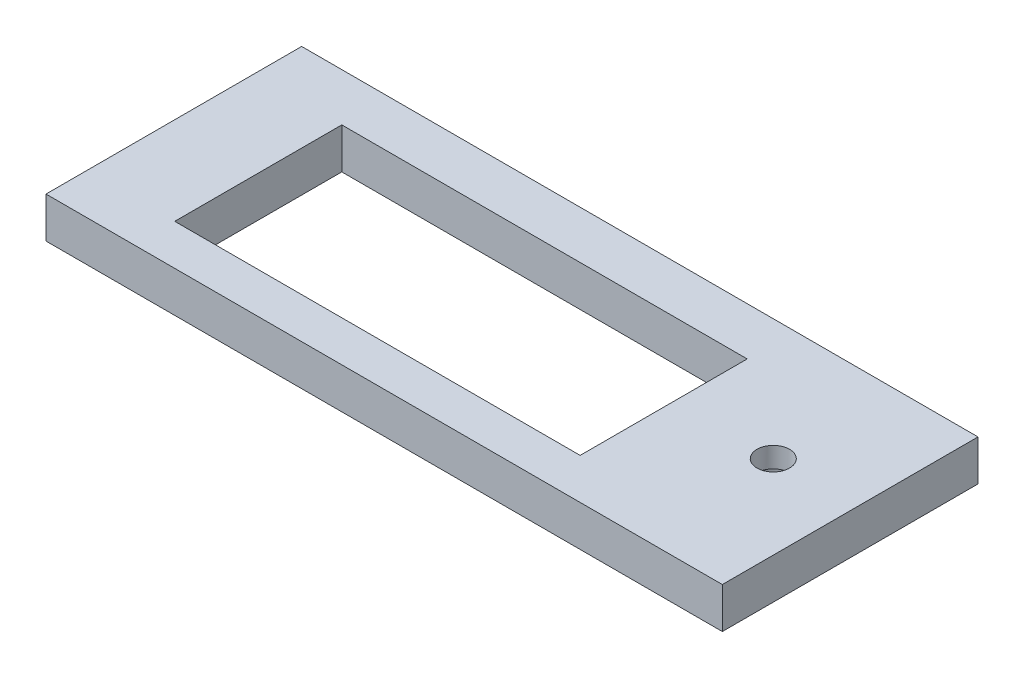
ISO-10303-21;
HEADER;
FILE_DESCRIPTION(('STEP AP214'),'2;1');
FILE_NAME('part.step','',(''),(''),'','','');
FILE_SCHEMA(('AUTOMOTIVE_DESIGN { 1 0 10303 214 1 1 1 1 }'));
ENDSEC;
DATA;
#1=APPLICATION_CONTEXT('core data for automotive mechanical design processes');
#2=APPLICATION_PROTOCOL_DEFINITION('international standard','automotive_design',2000,#1);
#3=PRODUCT_CONTEXT('',#1,'mechanical');
#4=PRODUCT('Part','Part','',(#3));
#5=PRODUCT_RELATED_PRODUCT_CATEGORY('part','',(#4));
#6=PRODUCT_DEFINITION_FORMATION('','',#4);
#7=PRODUCT_DEFINITION_CONTEXT('part definition',#1,'design');
#8=PRODUCT_DEFINITION('design','',#6,#7);
#9=PRODUCT_DEFINITION_SHAPE('','',#8);
#10=(LENGTH_UNIT() NAMED_UNIT(*) SI_UNIT(.MILLI.,.METRE.));
#11=(NAMED_UNIT(*) PLANE_ANGLE_UNIT() SI_UNIT($,.RADIAN.));
#12=(NAMED_UNIT(*) SI_UNIT($,.STERADIAN.) SOLID_ANGLE_UNIT());
#13=UNCERTAINTY_MEASURE_WITH_UNIT(LENGTH_MEASURE(1.E-05),#10,'distance_accuracy_value','');
#14=(GEOMETRIC_REPRESENTATION_CONTEXT(3) GLOBAL_UNCERTAINTY_ASSIGNED_CONTEXT((#13)) GLOBAL_UNIT_ASSIGNED_CONTEXT((#10,
#11,#12)) REPRESENTATION_CONTEXT('',''));
#15=CARTESIAN_POINT('',(0.,0.,0.));
#16=DIRECTION('',(0.,0.,1.));
#17=DIRECTION('',(1.,0.,0.));
#18=AXIS2_PLACEMENT_3D('',#15,#16,#17);
#19=CARTESIAN_POINT('',(62.5,0.,-1.62500000000001));
#20=DIRECTION('',(0.,1.,0.));
#21=DIRECTION('',(0.,0.,1.));
#22=AXIS2_PLACEMENT_3D('',#19,#20,#21);
#23=CYLINDRICAL_SURFACE('',#22,4.00000000000001);
#24=CARTESIAN_POINT('',(62.5,10.,-1.62500000000001));
#25=DIRECTION('',(0.,1.,0.));
#26=DIRECTION('',(0.,0.,1.));
#27=AXIS2_PLACEMENT_3D('',#24,#25,#26);
#28=CIRCLE('',#27,4.00000000000001);
#29=CARTESIAN_POINT('',(62.5,10.,2.375));
#30=VERTEX_POINT('',#29);
#31=EDGE_CURVE('E187',#30,#30,#28,.T.);
#32=ORIENTED_EDGE('',*,*,#31,.T.);
#33=EDGE_LOOP('',(#32));
#34=FACE_BOUND('',#33,.T.);
#35=CARTESIAN_POINT('',(62.5,5.,-1.62500000000001));
#36=DIRECTION('',(0.,-1.,0.));
#37=DIRECTION('',(0.,0.,-1.));
#38=AXIS2_PLACEMENT_3D('',#35,#36,#37);
#39=CIRCLE('',#38,4.00000000000001);
#40=CARTESIAN_POINT('',(62.5,5.,-5.62500000000001));
#41=VERTEX_POINT('',#40);
#42=EDGE_CURVE('E40',#41,#41,#39,.F.);
#43=ORIENTED_EDGE('',*,*,#42,.F.);
#44=EDGE_LOOP('',(#43));
#45=FACE_BOUND('',#44,.T.);
#46=ADVANCED_FACE('F36',(#34,#45),#23,.F.);
#47=CARTESIAN_POINT('',(-75.,10.,-31.375));
#48=DIRECTION('',(0.,0.,1.));
#49=DIRECTION('',(1.,0.,0.));
#50=AXIS2_PLACEMENT_3D('',#47,#48,#49);
#51=PLANE('',#50);
#52=DIRECTION('',(-1.,0.,0.));
#53=VECTOR('',#52,1.);
#54=CARTESIAN_POINT('',(-75.,0.,-31.375));
#55=LINE('',#54,#53);
#56=CARTESIAN_POINT('',(83.,0.,-31.375));
#57=VERTEX_POINT('',#56);
#58=CARTESIAN_POINT('',(-83.,0.,-31.375));
#59=VERTEX_POINT('',#58);
#60=EDGE_CURVE('E247',#57,#59,#55,.T.);
#61=ORIENTED_EDGE('',*,*,#60,.T.);
#62=DIRECTION('',(0.,1.,0.));
#63=VECTOR('',#62,1.);
#64=CARTESIAN_POINT('',(-83.,0.,-31.375));
#65=LINE('',#64,#63);
#66=CARTESIAN_POINT('',(-83.,10.,-31.375));
#67=VERTEX_POINT('',#66);
#68=EDGE_CURVE('E169',#59,#67,#65,.T.);
#69=ORIENTED_EDGE('',*,*,#68,.T.);
#70=DIRECTION('',(-1.,0.,0.));
#71=VECTOR('',#70,1.);
#72=CARTESIAN_POINT('',(-75.,10.,-31.375));
#73=LINE('',#72,#71);
#74=CARTESIAN_POINT('',(83.,10.,-31.375));
#75=VERTEX_POINT('',#74);
#76=EDGE_CURVE('E45',#75,#67,#73,.T.);
#77=ORIENTED_EDGE('',*,*,#76,.F.);
#78=DIRECTION('',(0.,1.,0.));
#79=VECTOR('',#78,1.);
#80=CARTESIAN_POINT('',(83.,0.,-31.375));
#81=LINE('',#80,#79);
#82=EDGE_CURVE('E160',#57,#75,#81,.T.);
#83=ORIENTED_EDGE('',*,*,#82,.F.);
#84=EDGE_LOOP('',(#61,#69,#77,#83));
#85=FACE_BOUND('',#84,.T.);
#86=ADVANCED_FACE('F38',(#85),#51,.F.);
#87=CARTESIAN_POINT('',(-75.,10.,31.375));
#88=DIRECTION('',(0.,0.,-1.));
#89=DIRECTION('',(-1.,0.,0.));
#90=AXIS2_PLACEMENT_3D('',#87,#88,#89);
#91=PLANE('',#90);
#92=DIRECTION('',(1.,0.,0.));
#93=VECTOR('',#92,1.);
#94=CARTESIAN_POINT('',(-75.,0.,31.375));
#95=LINE('',#94,#93);
#96=CARTESIAN_POINT('',(-83.,0.,31.375));
#97=VERTEX_POINT('',#96);
#98=CARTESIAN_POINT('',(83.,0.,31.375));
#99=VERTEX_POINT('',#98);
#100=EDGE_CURVE('E253',#97,#99,#95,.T.);
#101=ORIENTED_EDGE('',*,*,#100,.T.);
#102=DIRECTION('',(0.,1.,0.));
#103=VECTOR('',#102,1.);
#104=CARTESIAN_POINT('',(83.,0.,31.375));
#105=LINE('',#104,#103);
#106=CARTESIAN_POINT('',(83.,10.,31.375));
#107=VERTEX_POINT('',#106);
#108=EDGE_CURVE('E156',#99,#107,#105,.T.);
#109=ORIENTED_EDGE('',*,*,#108,.T.);
#110=DIRECTION('',(1.,0.,0.));
#111=VECTOR('',#110,1.);
#112=CARTESIAN_POINT('',(-75.,10.,31.375));
#113=LINE('',#112,#111);
#114=CARTESIAN_POINT('',(-83.,10.,31.375));
#115=VERTEX_POINT('',#114);
#116=EDGE_CURVE('E11',#115,#107,#113,.T.);
#117=ORIENTED_EDGE('',*,*,#116,.F.);
#118=DIRECTION('',(0.,1.,0.));
#119=VECTOR('',#118,1.);
#120=CARTESIAN_POINT('',(-83.,0.,31.375));
#121=LINE('',#120,#119);
#122=EDGE_CURVE('E172',#97,#115,#121,.T.);
#123=ORIENTED_EDGE('',*,*,#122,.F.);
#124=EDGE_LOOP('',(#101,#109,#117,#123));
#125=FACE_BOUND('',#124,.T.);
#126=ADVANCED_FACE('F288',(#125),#91,.F.);
#127=CARTESIAN_POINT('',(0.,10.,0.));
#128=DIRECTION('',(0.,-1.,0.));
#129=DIRECTION('',(0.,0.,-1.));
#130=AXIS2_PLACEMENT_3D('',#127,#128,#129);
#131=PLANE('',#130);
#132=ORIENTED_EDGE('',*,*,#31,.F.);
#133=EDGE_LOOP('',(#132));
#134=FACE_BOUND('',#133,.T.);
#135=DIRECTION('',(-1.,0.,0.));
#136=VECTOR('',#135,1.);
#137=CARTESIAN_POINT('',(-61.4,10.,-19.625));
#138=LINE('',#137,#136);
#139=CARTESIAN_POINT('',(38.1,10.,-19.625));
#140=VERTEX_POINT('',#139);
#141=CARTESIAN_POINT('',(-61.4,10.,-19.625));
#142=VERTEX_POINT('',#141);
#143=EDGE_CURVE('E237',#140,#142,#138,.T.);
#144=ORIENTED_EDGE('',*,*,#143,.F.);
#145=DIRECTION('',(0.,0.,-1.));
#146=VECTOR('',#145,1.);
#147=CARTESIAN_POINT('',(38.1,10.,21.375));
#148=LINE('',#147,#146);
#149=CARTESIAN_POINT('',(38.1,10.,21.375));
#150=VERTEX_POINT('',#149);
#151=EDGE_CURVE('E61',#150,#140,#148,.T.);
#152=ORIENTED_EDGE('',*,*,#151,.F.);
#153=DIRECTION('',(1.,0.,0.));
#154=VECTOR('',#153,1.);
#155=CARTESIAN_POINT('',(-61.4,10.,21.375));
#156=LINE('',#155,#154);
#157=CARTESIAN_POINT('',(-61.4,10.,21.375));
#158=VERTEX_POINT('',#157);
#159=EDGE_CURVE('E226',#158,#150,#156,.T.);
#160=ORIENTED_EDGE('',*,*,#159,.F.);
#161=DIRECTION('',(0.,0.,1.));
#162=VECTOR('',#161,1.);
#163=CARTESIAN_POINT('',(-61.4,10.,21.375));
#164=LINE('',#163,#162);
#165=EDGE_CURVE('E240',#142,#158,#164,.T.);
#166=ORIENTED_EDGE('',*,*,#165,.F.);
#167=EDGE_LOOP('',(#144,#152,#160,#166));
#168=FACE_BOUND('',#167,.T.);
#169=ORIENTED_EDGE('',*,*,#116,.T.);
#170=DIRECTION('',(0.,0.,-1.));
#171=VECTOR('',#170,1.);
#172=CARTESIAN_POINT('',(83.,10.,-31.375));
#173=LINE('',#172,#171);
#174=EDGE_CURVE('E157',#107,#75,#173,.T.);
#175=ORIENTED_EDGE('',*,*,#174,.T.);
#176=ORIENTED_EDGE('',*,*,#76,.T.);
#177=DIRECTION('',(0.,0.,1.));
#178=VECTOR('',#177,1.);
#179=CARTESIAN_POINT('',(-83.,10.,-31.375));
#180=LINE('',#179,#178);
#181=EDGE_CURVE('E163',#67,#115,#180,.T.);
#182=ORIENTED_EDGE('',*,*,#181,.T.);
#183=EDGE_LOOP('',(#169,#175,#176,#182));
#184=FACE_BOUND('',#183,.T.);
#185=ADVANCED_FACE('F266',(#134,#168,#184),#131,.F.);
#186=CARTESIAN_POINT('',(0.,0.,0.));
#187=DIRECTION('',(0.,-1.,0.));
#188=DIRECTION('',(0.,0.,-1.));
#189=AXIS2_PLACEMENT_3D('',#186,#187,#188);
#190=PLANE('',#189);
#191=CARTESIAN_POINT('',(62.5,0.,-1.62500000000001));
#192=DIRECTION('',(0.,-1.,0.));
#193=DIRECTION('',(0.,0.,-1.));
#194=AXIS2_PLACEMENT_3D('',#191,#192,#193);
#195=CIRCLE('',#194,8.81447972948227);
#196=CARTESIAN_POINT('',(62.5,0.,-10.4394797294823));
#197=VERTEX_POINT('',#196);
#198=EDGE_CURVE('E605',#197,#197,#195,.T.);
#199=ORIENTED_EDGE('',*,*,#198,.F.);
#200=EDGE_LOOP('',(#199));
#201=FACE_BOUND('',#200,.T.);
#202=CARTESIAN_POINT('',(-79.,0.,-21.375));
#203=DIRECTION('',(0.,-1.,0.));
#204=DIRECTION('',(0.,0.,-1.));
#205=AXIS2_PLACEMENT_3D('',#202,#203,#204);
#206=CIRCLE('',#205,1.5);
#207=CARTESIAN_POINT('',(-79.,0.,-22.875));
#208=VERTEX_POINT('',#207);
#209=EDGE_CURVE('E612',#208,#208,#206,.T.);
#210=ORIENTED_EDGE('',*,*,#209,.F.);
#211=EDGE_LOOP('',(#210));
#212=FACE_BOUND('',#211,.T.);
#213=CARTESIAN_POINT('',(79.,0.,-21.375));
#214=DIRECTION('',(0.,-1.,0.));
#215=DIRECTION('',(0.,0.,-1.));
#216=AXIS2_PLACEMENT_3D('',#213,#214,#215);
#217=CIRCLE('',#216,1.5);
#218=CARTESIAN_POINT('',(79.,0.,-22.875));
#219=VERTEX_POINT('',#218);
#220=EDGE_CURVE('E146',#219,#219,#217,.T.);
#221=ORIENTED_EDGE('',*,*,#220,.F.);
#222=EDGE_LOOP('',(#221));
#223=FACE_BOUND('',#222,.T.);
#224=CARTESIAN_POINT('',(-79.,0.,17.1480115625267));
#225=DIRECTION('',(0.,-1.,0.));
#226=DIRECTION('',(0.,0.,1.));
#227=AXIS2_PLACEMENT_3D('',#224,#225,#226);
#228=ELLIPSE('',#227,1.76776695296635,1.24999999999999);
#229=CARTESIAN_POINT('',(-79.,0.,18.9157785154931));
#230=VERTEX_POINT('',#229);
#231=EDGE_CURVE('E140',#230,#230,#228,.T.);
#232=ORIENTED_EDGE('',*,*,#231,.F.);
#233=EDGE_LOOP('',(#232));
#234=FACE_BOUND('',#233,.T.);
#235=CARTESIAN_POINT('',(79.,0.,8.66273018828805));
#236=DIRECTION('',(0.,-1.,0.));
#237=DIRECTION('',(0.,0.,1.));
#238=AXIS2_PLACEMENT_3D('',#235,#236,#237);
#239=ELLIPSE('',#238,1.76776695296635,1.24999999999999);
#240=CARTESIAN_POINT('',(79.,0.,10.4304971412544));
#241=VERTEX_POINT('',#240);
#242=EDGE_CURVE('E152',#241,#241,#239,.T.);
#243=ORIENTED_EDGE('',*,*,#242,.F.);
#244=EDGE_LOOP('',(#243));
#245=FACE_BOUND('',#244,.T.);
#246=CARTESIAN_POINT('',(62.,0.,14.625));
#247=DIRECTION('',(0.,-1.,0.));
#248=DIRECTION('',(0.,0.,-1.));
#249=AXIS2_PLACEMENT_3D('',#246,#247,#248);
#250=CIRCLE('',#249,3.50000000000001);
#251=CARTESIAN_POINT('',(62.,0.,11.125));
#252=VERTEX_POINT('',#251);
#253=EDGE_CURVE('E175',#252,#252,#250,.T.);
#254=ORIENTED_EDGE('',*,*,#253,.F.);
#255=EDGE_LOOP('',(#254));
#256=FACE_BOUND('',#255,.T.);
#257=CARTESIAN_POINT('',(61.,0.,-20.625));
#258=DIRECTION('',(0.,-1.,0.));
#259=DIRECTION('',(0.,0.,-1.));
#260=AXIS2_PLACEMENT_3D('',#257,#258,#259);
#261=CIRCLE('',#260,6.5);
#262=CARTESIAN_POINT('',(61.,0.,-27.125));
#263=VERTEX_POINT('',#262);
#264=EDGE_CURVE('E181',#263,#263,#261,.T.);
#265=ORIENTED_EDGE('',*,*,#264,.F.);
#266=EDGE_LOOP('',(#265));
#267=FACE_BOUND('',#266,.T.);
#268=DIRECTION('',(0.,0.,1.));
#269=VECTOR('',#268,1.);
#270=CARTESIAN_POINT('',(8.60000000000001,0.,-28.575));
#271=LINE('',#270,#269);
#272=CARTESIAN_POINT('',(8.60000000000001,0.,-28.575));
#273=VERTEX_POINT('',#272);
#274=CARTESIAN_POINT('',(8.60000000000001,0.,-24.575));
#275=VERTEX_POINT('',#274);
#276=EDGE_CURVE('E53',#273,#275,#271,.T.);
#277=ORIENTED_EDGE('',*,*,#276,.F.);
#278=DIRECTION('',(1.,0.,0.));
#279=VECTOR('',#278,1.);
#280=CARTESIAN_POINT('',(8.60000000000001,0.,-28.575));
#281=LINE('',#280,#279);
#282=CARTESIAN_POINT('',(-61.4,0.,-28.575));
#283=VERTEX_POINT('',#282);
#284=EDGE_CURVE('E196',#283,#273,#281,.T.);
#285=ORIENTED_EDGE('',*,*,#284,.F.);
#286=DIRECTION('',(0.,0.,-1.));
#287=VECTOR('',#286,1.);
#288=CARTESIAN_POINT('',(-61.4,0.,-28.575));
#289=LINE('',#288,#287);
#290=CARTESIAN_POINT('',(-61.4,0.,-24.575));
#291=VERTEX_POINT('',#290);
#292=EDGE_CURVE('E210',#291,#283,#289,.T.);
#293=ORIENTED_EDGE('',*,*,#292,.F.);
#294=DIRECTION('',(-1.,0.,0.));
#295=VECTOR('',#294,1.);
#296=CARTESIAN_POINT('',(8.60000000000001,0.,-24.575));
#297=LINE('',#296,#295);
#298=EDGE_CURVE('E207',#275,#291,#297,.T.);
#299=ORIENTED_EDGE('',*,*,#298,.F.);
#300=EDGE_LOOP('',(#277,#285,#293,#299));
#301=FACE_BOUND('',#300,.T.);
#302=DIRECTION('',(0.,0.,-1.));
#303=VECTOR('',#302,1.);
#304=CARTESIAN_POINT('',(38.1,0.,21.375));
#305=LINE('',#304,#303);
#306=CARTESIAN_POINT('',(38.1,0.,21.375));
#307=VERTEX_POINT('',#306);
#308=CARTESIAN_POINT('',(38.1,0.,-19.625));
#309=VERTEX_POINT('',#308);
#310=EDGE_CURVE('E222',#307,#309,#305,.T.);
#311=ORIENTED_EDGE('',*,*,#310,.T.);
#312=DIRECTION('',(-1.,0.,0.));
#313=VECTOR('',#312,1.);
#314=CARTESIAN_POINT('',(-61.4,0.,-19.625));
#315=LINE('',#314,#313);
#316=CARTESIAN_POINT('',(-61.4,0.,-19.625));
#317=VERTEX_POINT('',#316);
#318=EDGE_CURVE('E225',#309,#317,#315,.T.);
#319=ORIENTED_EDGE('',*,*,#318,.T.);
#320=DIRECTION('',(0.,0.,1.));
#321=VECTOR('',#320,1.);
#322=CARTESIAN_POINT('',(-61.4,0.,21.375));
#323=LINE('',#322,#321);
#324=CARTESIAN_POINT('',(-61.4,0.,21.375));
#325=VERTEX_POINT('',#324);
#326=EDGE_CURVE('E229',#317,#325,#323,.T.);
#327=ORIENTED_EDGE('',*,*,#326,.T.);
#328=DIRECTION('',(1.,0.,0.));
#329=VECTOR('',#328,1.);
#330=CARTESIAN_POINT('',(-61.4,0.,21.375));
#331=LINE('',#330,#329);
#332=EDGE_CURVE('E232',#325,#307,#331,.T.);
#333=ORIENTED_EDGE('',*,*,#332,.T.);
#334=EDGE_LOOP('',(#311,#319,#327,#333));
#335=FACE_BOUND('',#334,.T.);
#336=ORIENTED_EDGE('',*,*,#60,.F.);
#337=DIRECTION('',(0.,0.,-1.));
#338=VECTOR('',#337,1.);
#339=CARTESIAN_POINT('',(83.,0.,-31.375));
#340=LINE('',#339,#338);
#341=EDGE_CURVE('E153',#99,#57,#340,.T.);
#342=ORIENTED_EDGE('',*,*,#341,.F.);
#343=ORIENTED_EDGE('',*,*,#100,.F.);
#344=DIRECTION('',(0.,0.,1.));
#345=VECTOR('',#344,1.);
#346=CARTESIAN_POINT('',(-83.,0.,-31.375));
#347=LINE('',#346,#345);
#348=EDGE_CURVE('E166',#59,#97,#347,.T.);
#349=ORIENTED_EDGE('',*,*,#348,.F.);
#350=EDGE_LOOP('',(#336,#342,#343,#349));
#351=FACE_BOUND('',#350,.T.);
#352=ADVANCED_FACE('F262',(#201,#212,#223,#234,#245,#256,#267,#301,#335,#351),#190,.T.);
#353=CARTESIAN_POINT('',(38.1,0.,21.375));
#354=DIRECTION('',(1.,0.,0.));
#355=DIRECTION('',(0.,0.,-1.));
#356=AXIS2_PLACEMENT_3D('',#353,#354,#355);
#357=PLANE('',#356);
#358=ORIENTED_EDGE('',*,*,#151,.T.);
#359=DIRECTION('',(0.,1.,0.));
#360=VECTOR('',#359,1.);
#361=CARTESIAN_POINT('',(38.1,0.,-19.625));
#362=LINE('',#361,#360);
#363=EDGE_CURVE('E235',#309,#140,#362,.T.);
#364=ORIENTED_EDGE('',*,*,#363,.F.);
#365=ORIENTED_EDGE('',*,*,#310,.F.);
#366=DIRECTION('',(0.,1.,0.));
#367=VECTOR('',#366,1.);
#368=CARTESIAN_POINT('',(38.1,0.,21.375));
#369=LINE('',#368,#367);
#370=EDGE_CURVE('E245',#307,#150,#369,.T.);
#371=ORIENTED_EDGE('',*,*,#370,.T.);
#372=EDGE_LOOP('',(#358,#364,#365,#371));
#373=FACE_BOUND('',#372,.T.);
#374=ADVANCED_FACE('F265',(#373),#357,.F.);
#375=CARTESIAN_POINT('',(-61.4,0.,21.375));
#376=DIRECTION('',(0.,0.,1.));
#377=DIRECTION('',(1.,0.,0.));
#378=AXIS2_PLACEMENT_3D('',#375,#376,#377);
#379=PLANE('',#378);
#380=ORIENTED_EDGE('',*,*,#159,.T.);
#381=ORIENTED_EDGE('',*,*,#370,.F.);
#382=ORIENTED_EDGE('',*,*,#332,.F.);
#383=DIRECTION('',(0.,1.,0.));
#384=VECTOR('',#383,1.);
#385=CARTESIAN_POINT('',(-61.4,0.,21.375));
#386=LINE('',#385,#384);
#387=EDGE_CURVE('E248',#325,#158,#386,.T.);
#388=ORIENTED_EDGE('',*,*,#387,.T.);
#389=EDGE_LOOP('',(#380,#381,#382,#388));
#390=FACE_BOUND('',#389,.T.);
#391=ADVANCED_FACE('F334',(#390),#379,.F.);
#392=CARTESIAN_POINT('',(-61.4,0.,21.375));
#393=DIRECTION('',(-1.,0.,0.));
#394=DIRECTION('',(0.,0.,1.));
#395=AXIS2_PLACEMENT_3D('',#392,#393,#394);
#396=PLANE('',#395);
#397=ORIENTED_EDGE('',*,*,#165,.T.);
#398=ORIENTED_EDGE('',*,*,#387,.F.);
#399=ORIENTED_EDGE('',*,*,#326,.F.);
#400=DIRECTION('',(0.,1.,0.));
#401=VECTOR('',#400,1.);
#402=CARTESIAN_POINT('',(-61.4,0.,-19.625));
#403=LINE('',#402,#401);
#404=EDGE_CURVE('E250',#317,#142,#403,.T.);
#405=ORIENTED_EDGE('',*,*,#404,.T.);
#406=EDGE_LOOP('',(#397,#398,#399,#405));
#407=FACE_BOUND('',#406,.T.);
#408=ADVANCED_FACE('F337',(#407),#396,.F.);
#409=CARTESIAN_POINT('',(-61.4,0.,-19.625));
#410=DIRECTION('',(0.,0.,-1.));
#411=DIRECTION('',(-1.,0.,0.));
#412=AXIS2_PLACEMENT_3D('',#409,#410,#411);
#413=PLANE('',#412);
#414=ORIENTED_EDGE('',*,*,#143,.T.);
#415=ORIENTED_EDGE('',*,*,#404,.F.);
#416=ORIENTED_EDGE('',*,*,#318,.F.);
#417=ORIENTED_EDGE('',*,*,#363,.T.);
#418=EDGE_LOOP('',(#414,#415,#416,#417));
#419=FACE_BOUND('',#418,.T.);
#420=ADVANCED_FACE('F333',(#419),#413,.F.);
#421=CARTESIAN_POINT('',(8.60000000000001,7.,-28.575));
#422=DIRECTION('',(1.,0.,0.));
#423=DIRECTION('',(0.,0.,-1.));
#424=AXIS2_PLACEMENT_3D('',#421,#422,#423);
#425=PLANE('',#424);
#426=ORIENTED_EDGE('',*,*,#276,.T.);
#427=DIRECTION('',(0.,-1.,0.));
#428=VECTOR('',#427,1.);
#429=CARTESIAN_POINT('',(8.60000000000001,7.,-24.575));
#430=LINE('',#429,#428);
#431=CARTESIAN_POINT('',(8.60000000000001,7.,-24.575));
#432=VERTEX_POINT('',#431);
#433=EDGE_CURVE('E205',#432,#275,#430,.T.);
#434=ORIENTED_EDGE('',*,*,#433,.F.);
#435=DIRECTION('',(0.,0.,1.));
#436=VECTOR('',#435,1.);
#437=CARTESIAN_POINT('',(8.60000000000001,7.,-28.575));
#438=LINE('',#437,#436);
#439=CARTESIAN_POINT('',(8.60000000000001,7.,-28.575));
#440=VERTEX_POINT('',#439);
#441=EDGE_CURVE('E192',#440,#432,#438,.T.);
#442=ORIENTED_EDGE('',*,*,#441,.F.);
#443=DIRECTION('',(0.,-1.,0.));
#444=VECTOR('',#443,1.);
#445=CARTESIAN_POINT('',(8.60000000000001,7.,-28.575));
#446=LINE('',#445,#444);
#447=EDGE_CURVE('E215',#440,#273,#446,.T.);
#448=ORIENTED_EDGE('',*,*,#447,.T.);
#449=EDGE_LOOP('',(#426,#434,#442,#448));
#450=FACE_BOUND('',#449,.T.);
#451=ADVANCED_FACE('F323',(#450),#425,.F.);
#452=CARTESIAN_POINT('',(8.60000000000001,7.,-28.575));
#453=DIRECTION('',(0.,0.,-1.));
#454=DIRECTION('',(-1.,0.,0.));
#455=AXIS2_PLACEMENT_3D('',#452,#453,#454);
#456=PLANE('',#455);
#457=ORIENTED_EDGE('',*,*,#284,.T.);
#458=ORIENTED_EDGE('',*,*,#447,.F.);
#459=DIRECTION('',(1.,0.,0.));
#460=VECTOR('',#459,1.);
#461=CARTESIAN_POINT('',(8.60000000000001,7.,-28.575));
#462=LINE('',#461,#460);
#463=CARTESIAN_POINT('',(-61.4,7.,-28.575));
#464=VERTEX_POINT('',#463);
#465=EDGE_CURVE('E202',#464,#440,#462,.T.);
#466=ORIENTED_EDGE('',*,*,#465,.F.);
#467=DIRECTION('',(0.,-1.,0.));
#468=VECTOR('',#467,1.);
#469=CARTESIAN_POINT('',(-61.4,7.,-28.575));
#470=LINE('',#469,#468);
#471=EDGE_CURVE('E217',#464,#283,#470,.T.);
#472=ORIENTED_EDGE('',*,*,#471,.T.);
#473=EDGE_LOOP('',(#457,#458,#466,#472));
#474=FACE_BOUND('',#473,.T.);
#475=ADVANCED_FACE('F319',(#474),#456,.F.);
#476=CARTESIAN_POINT('',(-61.4,7.,-28.575));
#477=DIRECTION('',(-1.,0.,0.));
#478=DIRECTION('',(0.,0.,1.));
#479=AXIS2_PLACEMENT_3D('',#476,#477,#478);
#480=PLANE('',#479);
#481=ORIENTED_EDGE('',*,*,#292,.T.);
#482=ORIENTED_EDGE('',*,*,#471,.F.);
#483=DIRECTION('',(0.,0.,-1.));
#484=VECTOR('',#483,1.);
#485=CARTESIAN_POINT('',(-61.4,7.,-28.575));
#486=LINE('',#485,#484);
#487=CARTESIAN_POINT('',(-61.4,7.,-24.575));
#488=VERTEX_POINT('',#487);
#489=EDGE_CURVE('E199',#488,#464,#486,.T.);
#490=ORIENTED_EDGE('',*,*,#489,.F.);
#491=DIRECTION('',(0.,-1.,0.));
#492=VECTOR('',#491,1.);
#493=CARTESIAN_POINT('',(-61.4,7.,-24.575));
#494=LINE('',#493,#492);
#495=EDGE_CURVE('E219',#488,#291,#494,.T.);
#496=ORIENTED_EDGE('',*,*,#495,.T.);
#497=EDGE_LOOP('',(#481,#482,#490,#496));
#498=FACE_BOUND('',#497,.T.);
#499=ADVANCED_FACE('F322',(#498),#480,.F.);
#500=CARTESIAN_POINT('',(8.60000000000001,7.,-24.575));
#501=DIRECTION('',(0.,0.,1.));
#502=DIRECTION('',(1.,0.,0.));
#503=AXIS2_PLACEMENT_3D('',#500,#501,#502);
#504=PLANE('',#503);
#505=ORIENTED_EDGE('',*,*,#298,.T.);
#506=ORIENTED_EDGE('',*,*,#495,.F.);
#507=DIRECTION('',(-1.,0.,0.));
#508=VECTOR('',#507,1.);
#509=CARTESIAN_POINT('',(8.60000000000001,7.,-24.575));
#510=LINE('',#509,#508);
#511=EDGE_CURVE('E195',#432,#488,#510,.T.);
#512=ORIENTED_EDGE('',*,*,#511,.F.);
#513=ORIENTED_EDGE('',*,*,#433,.T.);
#514=EDGE_LOOP('',(#505,#506,#512,#513));
#515=FACE_BOUND('',#514,.T.);
#516=ADVANCED_FACE('F317',(#515),#504,.F.);
#517=CARTESIAN_POINT('',(0.,7.,0.));
#518=DIRECTION('',(0.,-1.,0.));
#519=DIRECTION('',(0.,0.,-1.));
#520=AXIS2_PLACEMENT_3D('',#517,#518,#519);
#521=PLANE('',#520);
#522=ORIENTED_EDGE('',*,*,#441,.T.);
#523=ORIENTED_EDGE('',*,*,#511,.T.);
#524=ORIENTED_EDGE('',*,*,#489,.T.);
#525=ORIENTED_EDGE('',*,*,#465,.T.);
#526=EDGE_LOOP('',(#522,#523,#524,#525));
#527=FACE_BOUND('',#526,.T.);
#528=ADVANCED_FACE('F314',(#527),#521,.T.);
#529=CARTESIAN_POINT('',(61.,7.,-20.625));
#530=DIRECTION('',(0.,-1.,0.));
#531=DIRECTION('',(0.,0.,-1.));
#532=AXIS2_PLACEMENT_3D('',#529,#530,#531);
#533=CYLINDRICAL_SURFACE('',#532,6.5);
#534=CARTESIAN_POINT('',(61.,7.,-20.625));
#535=DIRECTION('',(0.,-1.,0.));
#536=DIRECTION('',(0.,0.,-1.));
#537=AXIS2_PLACEMENT_3D('',#534,#535,#536);
#538=CIRCLE('',#537,6.5);
#539=CARTESIAN_POINT('',(61.,7.,-27.125));
#540=VERTEX_POINT('',#539);
#541=EDGE_CURVE('E184',#540,#540,#538,.T.);
#542=ORIENTED_EDGE('',*,*,#541,.F.);
#543=EDGE_LOOP('',(#542));
#544=FACE_BOUND('',#543,.T.);
#545=ORIENTED_EDGE('',*,*,#264,.T.);
#546=EDGE_LOOP('',(#545));
#547=FACE_BOUND('',#546,.T.);
#548=ADVANCED_FACE('F312',(#544,#547),#533,.F.);
#549=CARTESIAN_POINT('',(61.,7.,-20.625));
#550=DIRECTION('',(0.,-1.,0.));
#551=DIRECTION('',(0.,0.,-1.));
#552=AXIS2_PLACEMENT_3D('',#549,#550,#551);
#553=PLANE('',#552);
#554=ORIENTED_EDGE('',*,*,#541,.T.);
#555=EDGE_LOOP('',(#554));
#556=FACE_BOUND('',#555,.T.);
#557=ADVANCED_FACE('F387',(#556),#553,.T.);
#558=CARTESIAN_POINT('',(62.,7.,14.625));
#559=DIRECTION('',(0.,-1.,0.));
#560=DIRECTION('',(0.,0.,-1.));
#561=AXIS2_PLACEMENT_3D('',#558,#559,#560);
#562=CYLINDRICAL_SURFACE('',#561,3.50000000000001);
#563=CARTESIAN_POINT('',(62.,7.,14.625));
#564=DIRECTION('',(0.,-1.,0.));
#565=DIRECTION('',(0.,0.,-1.));
#566=AXIS2_PLACEMENT_3D('',#563,#564,#565);
#567=CIRCLE('',#566,3.50000000000001);
#568=CARTESIAN_POINT('',(62.,7.,11.125));
#569=VERTEX_POINT('',#568);
#570=EDGE_CURVE('E178',#569,#569,#567,.T.);
#571=ORIENTED_EDGE('',*,*,#570,.F.);
#572=EDGE_LOOP('',(#571));
#573=FACE_BOUND('',#572,.T.);
#574=ORIENTED_EDGE('',*,*,#253,.T.);
#575=EDGE_LOOP('',(#574));
#576=FACE_BOUND('',#575,.T.);
#577=ADVANCED_FACE('F394',(#573,#576),#562,.F.);
#578=CARTESIAN_POINT('',(62.,7.,14.625));
#579=DIRECTION('',(0.,-1.,0.));
#580=DIRECTION('',(0.,0.,-1.));
#581=AXIS2_PLACEMENT_3D('',#578,#579,#580);
#582=PLANE('',#581);
#583=ORIENTED_EDGE('',*,*,#570,.T.);
#584=EDGE_LOOP('',(#583));
#585=FACE_BOUND('',#584,.T.);
#586=ADVANCED_FACE('F401',(#585),#582,.T.);
#587=CARTESIAN_POINT('',(-83.,0.,-31.375));
#588=DIRECTION('',(-1.,0.,0.));
#589=DIRECTION('',(0.,0.,1.));
#590=AXIS2_PLACEMENT_3D('',#587,#588,#589);
#591=PLANE('',#590);
#592=ORIENTED_EDGE('',*,*,#181,.F.);
#593=ORIENTED_EDGE('',*,*,#68,.F.);
#594=ORIENTED_EDGE('',*,*,#348,.T.);
#595=ORIENTED_EDGE('',*,*,#122,.T.);
#596=EDGE_LOOP('',(#592,#593,#594,#595));
#597=FACE_BOUND('',#596,.T.);
#598=ADVANCED_FACE('F292',(#597),#591,.T.);
#599=CARTESIAN_POINT('',(83.,0.,-31.375));
#600=DIRECTION('',(1.,0.,0.));
#601=DIRECTION('',(0.,0.,-1.));
#602=AXIS2_PLACEMENT_3D('',#599,#600,#601);
#603=PLANE('',#602);
#604=ORIENTED_EDGE('',*,*,#174,.F.);
#605=ORIENTED_EDGE('',*,*,#108,.F.);
#606=ORIENTED_EDGE('',*,*,#341,.T.);
#607=ORIENTED_EDGE('',*,*,#82,.T.);
#608=EDGE_LOOP('',(#604,#605,#606,#607));
#609=FACE_BOUND('',#608,.T.);
#610=ADVANCED_FACE('F286',(#609),#603,.T.);
#611=CARTESIAN_POINT('',(79.,6.32153462380769,2.34119556448034));
#612=DIRECTION('',(0.,-0.707106781186546,0.707106781186549));
#613=DIRECTION('',(0.,-0.707106781186549,-0.707106781186546));
#614=AXIS2_PLACEMENT_3D('',#611,#612,#613);
#615=CONICAL_SURFACE('',#614,1.24999999999999,1.02974425867665);
#616=CARTESIAN_POINT('',(79.,6.8526253966356,1.81010479165243));
#617=VERTEX_POINT('',#616);
#618=VERTEX_LOOP('',#617);
#619=FACE_BOUND('',#618,.T.);
#620=CARTESIAN_POINT('',(79.,6.32153462380769,2.34119556448034));
#621=DIRECTION('',(0.,-0.707106781186546,0.707106781186549));
#622=DIRECTION('',(0.,-0.707106781186549,-0.707106781186546));
#623=AXIS2_PLACEMENT_3D('',#620,#621,#622);
#624=CIRCLE('',#623,1.24999999999999);
#625=CARTESIAN_POINT('',(79.,5.43765114732451,1.45731208799717));
#626=VERTEX_POINT('',#625);
#627=EDGE_CURVE('E144',#626,#626,#624,.T.);
#628=ORIENTED_EDGE('',*,*,#627,.T.);
#629=EDGE_LOOP('',(#628));
#630=FACE_BOUND('',#629,.T.);
#631=ADVANCED_FACE('F423',(#619,#630),#615,.F.);
#632=CARTESIAN_POINT('',(79.,-11.356134905856,20.0188650941441));
#633=DIRECTION('',(0.,-0.707106781186546,0.707106781186549));
#634=DIRECTION('',(0.,-0.707106781186549,-0.707106781186546));
#635=AXIS2_PLACEMENT_3D('',#632,#633,#634);
#636=CYLINDRICAL_SURFACE('',#635,1.24999999999999);
#637=ORIENTED_EDGE('',*,*,#242,.T.);
#638=EDGE_LOOP('',(#637));
#639=FACE_BOUND('',#638,.T.);
#640=ORIENTED_EDGE('',*,*,#627,.F.);
#641=EDGE_LOOP('',(#640));
#642=FACE_BOUND('',#641,.T.);
#643=ADVANCED_FACE('F134',(#639,#642),#636,.F.);
#644=CARTESIAN_POINT('',(-79.,7.73574818618094,9.41226337634587));
#645=DIRECTION('',(0.,-0.707106781186551,0.707106781186544));
#646=DIRECTION('',(0.,-0.707106781186544,-0.707106781186551));
#647=AXIS2_PLACEMENT_3D('',#644,#645,#646);
#648=CONICAL_SURFACE('',#647,1.25,1.02974425867665);
#649=CARTESIAN_POINT('',(-79.,8.26683895900886,8.88117260351796));
#650=VERTEX_POINT('',#649);
#651=VERTEX_LOOP('',#650);
#652=FACE_BOUND('',#651,.T.);
#653=CARTESIAN_POINT('',(-79.,7.73574818618094,9.41226337634587));
#654=DIRECTION('',(0.,-0.707106781186551,0.707106781186544));
#655=DIRECTION('',(0.,-0.707106781186544,-0.707106781186551));
#656=AXIS2_PLACEMENT_3D('',#653,#654,#655);
#657=CIRCLE('',#656,1.25);
#658=CARTESIAN_POINT('',(-79.,6.85186470969776,8.52837989986268));
#659=VERTEX_POINT('',#658);
#660=EDGE_CURVE('E138',#659,#659,#657,.T.);
#661=ORIENTED_EDGE('',*,*,#660,.T.);
#662=EDGE_LOOP('',(#661));
#663=FACE_BOUND('',#662,.T.);
#664=ADVANCED_FACE('F130',(#652,#663),#648,.F.);
#665=CARTESIAN_POINT('',(-79.,-7.11349421873664,24.2615057812633));
#666=DIRECTION('',(0.,-0.707106781186551,0.707106781186544));
#667=DIRECTION('',(0.,-0.707106781186544,-0.707106781186551));
#668=AXIS2_PLACEMENT_3D('',#665,#666,#667);
#669=CYLINDRICAL_SURFACE('',#668,1.24999999999999);
#670=ORIENTED_EDGE('',*,*,#231,.T.);
#671=EDGE_LOOP('',(#670));
#672=FACE_BOUND('',#671,.T.);
#673=ORIENTED_EDGE('',*,*,#660,.F.);
#674=EDGE_LOOP('',(#673));
#675=FACE_BOUND('',#674,.T.);
#676=ADVANCED_FACE('F133',(#672,#675),#669,.F.);
#677=CARTESIAN_POINT('',(79.,5.5,-21.375));
#678=DIRECTION('',(0.,-1.,0.));
#679=DIRECTION('',(0.,0.,-1.));
#680=AXIS2_PLACEMENT_3D('',#677,#678,#679);
#681=CYLINDRICAL_SURFACE('',#680,1.5);
#682=CARTESIAN_POINT('',(79.,5.5,-21.375));
#683=DIRECTION('',(0.,-1.,0.));
#684=DIRECTION('',(0.,0.,-1.));
#685=AXIS2_PLACEMENT_3D('',#682,#683,#684);
#686=CIRCLE('',#685,1.5);
#687=CARTESIAN_POINT('',(79.,5.5,-22.875));
#688=VERTEX_POINT('',#687);
#689=EDGE_CURVE('E141',#688,#688,#686,.T.);
#690=ORIENTED_EDGE('',*,*,#689,.F.);
#691=EDGE_LOOP('',(#690));
#692=FACE_BOUND('',#691,.T.);
#693=ORIENTED_EDGE('',*,*,#220,.T.);
#694=EDGE_LOOP('',(#693));
#695=FACE_BOUND('',#694,.T.);
#696=ADVANCED_FACE('F448',(#692,#695),#681,.F.);
#697=CARTESIAN_POINT('',(79.,5.5,-21.375));
#698=DIRECTION('',(0.,-1.,0.));
#699=DIRECTION('',(0.,0.,-1.));
#700=AXIS2_PLACEMENT_3D('',#697,#698,#699);
#701=PLANE('',#700);
#702=ORIENTED_EDGE('',*,*,#689,.T.);
#703=EDGE_LOOP('',(#702));
#704=FACE_BOUND('',#703,.T.);
#705=ADVANCED_FACE('F455',(#704),#701,.T.);
#706=CARTESIAN_POINT('',(-79.,5.5,-21.375));
#707=DIRECTION('',(0.,-1.,0.));
#708=DIRECTION('',(0.,0.,-1.));
#709=AXIS2_PLACEMENT_3D('',#706,#707,#708);
#710=CYLINDRICAL_SURFACE('',#709,1.5);
#711=CARTESIAN_POINT('',(-79.,5.5,-21.375));
#712=DIRECTION('',(0.,-1.,0.));
#713=DIRECTION('',(0.,0.,-1.));
#714=AXIS2_PLACEMENT_3D('',#711,#712,#713);
#715=CIRCLE('',#714,1.5);
#716=CARTESIAN_POINT('',(-79.,5.5,-22.875));
#717=VERTEX_POINT('',#716);
#718=EDGE_CURVE('E609',#717,#717,#715,.T.);
#719=ORIENTED_EDGE('',*,*,#718,.F.);
#720=EDGE_LOOP('',(#719));
#721=FACE_BOUND('',#720,.T.);
#722=ORIENTED_EDGE('',*,*,#209,.T.);
#723=EDGE_LOOP('',(#722));
#724=FACE_BOUND('',#723,.T.);
#725=ADVANCED_FACE('F463',(#721,#724),#710,.F.);
#726=CARTESIAN_POINT('',(-79.,5.5,-21.375));
#727=DIRECTION('',(0.,-1.,0.));
#728=DIRECTION('',(0.,0.,-1.));
#729=AXIS2_PLACEMENT_3D('',#726,#727,#728);
#730=PLANE('',#729);
#731=ORIENTED_EDGE('',*,*,#718,.T.);
#732=EDGE_LOOP('',(#731));
#733=FACE_BOUND('',#732,.T.);
#734=ADVANCED_FACE('F471',(#733),#730,.T.);
#735=CARTESIAN_POINT('',(62.5,5.,-1.62500000000001));
#736=DIRECTION('',(0.,-1.,0.));
#737=DIRECTION('',(0.,0.,-1.));
#738=AXIS2_PLACEMENT_3D('',#735,#736,#737);
#739=PLANE('',#738);
#740=CARTESIAN_POINT('',(62.5,5.,-1.62500000000001));
#741=DIRECTION('',(0.,-1.,0.));
#742=DIRECTION('',(0.,0.,-1.));
#743=AXIS2_PLACEMENT_3D('',#740,#741,#742);
#744=CIRCLE('',#743,8.81447972948227);
#745=CARTESIAN_POINT('',(62.5,5.,-10.4394797294823));
#746=VERTEX_POINT('',#745);
#747=EDGE_CURVE('E602',#746,#746,#744,.T.);
#748=ORIENTED_EDGE('',*,*,#747,.T.);
#749=EDGE_LOOP('',(#748));
#750=FACE_BOUND('',#749,.T.);
#751=ORIENTED_EDGE('',*,*,#42,.T.);
#752=EDGE_LOOP('',(#751));
#753=FACE_BOUND('',#752,.T.);
#754=ADVANCED_FACE('F479',(#750,#753),#739,.T.);
#755=CARTESIAN_POINT('',(62.5,5.,-1.62500000000001));
#756=DIRECTION('',(0.,-1.,0.));
#757=DIRECTION('',(0.,0.,-1.));
#758=AXIS2_PLACEMENT_3D('',#755,#756,#757);
#759=CYLINDRICAL_SURFACE('',#758,8.81447972948227);
#760=ORIENTED_EDGE('',*,*,#747,.F.);
#761=EDGE_LOOP('',(#760));
#762=FACE_BOUND('',#761,.T.);
#763=ORIENTED_EDGE('',*,*,#198,.T.);
#764=EDGE_LOOP('',(#763));
#765=FACE_BOUND('',#764,.T.);
#766=ADVANCED_FACE('F487',(#762,#765),#759,.F.);
#767=CLOSED_SHELL('',(#46,#86,#126,#185,#352,#374,#391,#408,#420,#451,#475,#499,#516,#528,#548,
#557,#577,#586,#598,#610,#631,#643,#664,#676,#696,#705,#725,#734,#754,#766));
#768=MANIFOLD_SOLID_BREP('B2',#767);
#769=ADVANCED_BREP_SHAPE_REPRESENTATION('',(#18,#768),#14);
#770=SHAPE_DEFINITION_REPRESENTATION(#9,#769);
ENDSEC;
END-ISO-10303-21;
